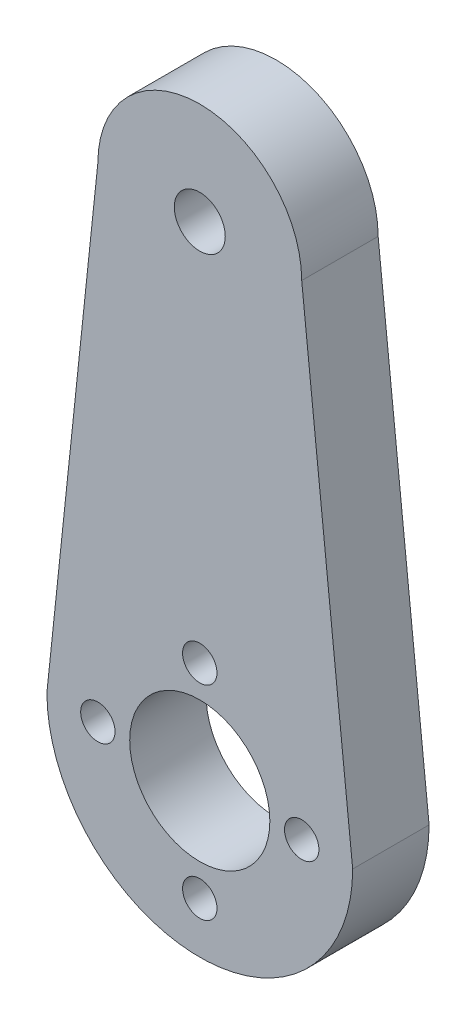
ISO-10303-21;
HEADER;
FILE_DESCRIPTION(('STEP AP214'),'2;1');
FILE_NAME('part.step','',(''),(''),'','','');
FILE_SCHEMA(('AUTOMOTIVE_DESIGN { 1 0 10303 214 1 1 1 1 }'));
ENDSEC;
DATA;
#1=APPLICATION_CONTEXT('core data for automotive mechanical design processes');
#2=APPLICATION_PROTOCOL_DEFINITION('international standard','automotive_design',2000,#1);
#3=PRODUCT_CONTEXT('',#1,'mechanical');
#4=PRODUCT('Part','Part','',(#3));
#5=PRODUCT_RELATED_PRODUCT_CATEGORY('part','',(#4));
#6=PRODUCT_DEFINITION_FORMATION('','',#4);
#7=PRODUCT_DEFINITION_CONTEXT('part definition',#1,'design');
#8=PRODUCT_DEFINITION('design','',#6,#7);
#9=PRODUCT_DEFINITION_SHAPE('','',#8);
#10=(LENGTH_UNIT() NAMED_UNIT(*) SI_UNIT(.MILLI.,.METRE.));
#11=(NAMED_UNIT(*) PLANE_ANGLE_UNIT() SI_UNIT($,.RADIAN.));
#12=(NAMED_UNIT(*) SI_UNIT($,.STERADIAN.) SOLID_ANGLE_UNIT());
#13=UNCERTAINTY_MEASURE_WITH_UNIT(LENGTH_MEASURE(1.E-05),#10,'distance_accuracy_value','');
#14=(GEOMETRIC_REPRESENTATION_CONTEXT(3) GLOBAL_UNCERTAINTY_ASSIGNED_CONTEXT((#13)) GLOBAL_UNIT_ASSIGNED_CONTEXT((#10,
#11,#12)) REPRESENTATION_CONTEXT('',''));
#15=CARTESIAN_POINT('',(0.,0.,0.));
#16=DIRECTION('',(0.,0.,1.));
#17=DIRECTION('',(1.,0.,0.));
#18=AXIS2_PLACEMENT_3D('',#15,#16,#17);
#19=CARTESIAN_POINT('',(0.,0.,6.));
#20=DIRECTION('',(0.,0.,-1.));
#21=DIRECTION('',(-1.,0.,0.));
#22=AXIS2_PLACEMENT_3D('',#19,#20,#21);
#23=CYLINDRICAL_SURFACE('',#22,12.);
#24=CARTESIAN_POINT('',(0.,0.,0.));
#25=DIRECTION('',(0.,0.,1.));
#26=DIRECTION('',(-1.,0.,0.));
#27=AXIS2_PLACEMENT_3D('',#24,#25,#26);
#28=CIRCLE('',#27,12.);
#29=CARTESIAN_POINT('',(-12.,0.,0.));
#30=VERTEX_POINT('',#29);
#31=CARTESIAN_POINT('',(12.,0.,0.));
#32=VERTEX_POINT('',#31);
#33=EDGE_CURVE('E95',#30,#32,#28,.T.);
#34=ORIENTED_EDGE('',*,*,#33,.T.);
#35=DIRECTION('',(0.,0.,-1.));
#36=VECTOR('',#35,1.);
#37=CARTESIAN_POINT('',(12.,0.,6.));
#38=LINE('',#37,#36);
#39=CARTESIAN_POINT('',(12.,0.,6.));
#40=VERTEX_POINT('',#39);
#41=EDGE_CURVE('E11',#40,#32,#38,.T.);
#42=ORIENTED_EDGE('',*,*,#41,.F.);
#43=CARTESIAN_POINT('',(0.,0.,6.));
#44=DIRECTION('',(0.,0.,1.));
#45=DIRECTION('',(-1.,0.,0.));
#46=AXIS2_PLACEMENT_3D('',#43,#44,#45);
#47=CIRCLE('',#46,12.);
#48=CARTESIAN_POINT('',(-12.,0.,6.));
#49=VERTEX_POINT('',#48);
#50=EDGE_CURVE('E83',#49,#40,#47,.T.);
#51=ORIENTED_EDGE('',*,*,#50,.F.);
#52=DIRECTION('',(0.,0.,-1.));
#53=VECTOR('',#52,1.);
#54=CARTESIAN_POINT('',(-12.,0.,6.));
#55=LINE('',#54,#53);
#56=EDGE_CURVE('E91',#49,#30,#55,.T.);
#57=ORIENTED_EDGE('',*,*,#56,.T.);
#58=EDGE_LOOP('',(#34,#42,#51,#57));
#59=FACE_BOUND('',#58,.T.);
#60=ADVANCED_FACE('F32',(#59),#23,.T.);
#61=CARTESIAN_POINT('',(12.,0.,6.));
#62=DIRECTION('',(-0.994505452921406,-0.104684784518043,0.));
#63=DIRECTION('',(0.104684784518043,-0.994505452921406,0.));
#64=AXIS2_PLACEMENT_3D('',#61,#62,#63);
#65=PLANE('',#64);
#66=DIRECTION('',(-0.104684784518043,0.994505452921406,0.));
#67=VECTOR('',#66,1.);
#68=CARTESIAN_POINT('',(12.,0.,0.));
#69=LINE('',#68,#67);
#70=CARTESIAN_POINT('',(8.,38.,0.));
#71=VERTEX_POINT('',#70);
#72=EDGE_CURVE('E87',#32,#71,#69,.T.);
#73=ORIENTED_EDGE('',*,*,#72,.T.);
#74=DIRECTION('',(0.,0.,-1.));
#75=VECTOR('',#74,1.);
#76=CARTESIAN_POINT('',(8.,38.,6.));
#77=LINE('',#76,#75);
#78=CARTESIAN_POINT('',(8.,38.,6.));
#79=VERTEX_POINT('',#78);
#80=EDGE_CURVE('E40',#79,#71,#77,.T.);
#81=ORIENTED_EDGE('',*,*,#80,.F.);
#82=DIRECTION('',(-0.104684784518043,0.994505452921406,0.));
#83=VECTOR('',#82,1.);
#84=CARTESIAN_POINT('',(12.,0.,6.));
#85=LINE('',#84,#83);
#86=EDGE_CURVE('E78',#40,#79,#85,.T.);
#87=ORIENTED_EDGE('',*,*,#86,.F.);
#88=ORIENTED_EDGE('',*,*,#41,.T.);
#89=EDGE_LOOP('',(#73,#81,#87,#88));
#90=FACE_BOUND('',#89,.T.);
#91=ADVANCED_FACE('F86',(#90),#65,.F.);
#92=CARTESIAN_POINT('',(0.,38.,6.));
#93=DIRECTION('',(0.,0.,-1.));
#94=DIRECTION('',(-1.,0.,0.));
#95=AXIS2_PLACEMENT_3D('',#92,#93,#94);
#96=CYLINDRICAL_SURFACE('',#95,8.);
#97=CARTESIAN_POINT('',(0.,38.,0.));
#98=DIRECTION('',(0.,0.,1.));
#99=DIRECTION('',(1.,0.,0.));
#100=AXIS2_PLACEMENT_3D('',#97,#98,#99);
#101=CIRCLE('',#100,8.);
#102=CARTESIAN_POINT('',(-8.,38.,0.));
#103=VERTEX_POINT('',#102);
#104=EDGE_CURVE('E65',#71,#103,#101,.T.);
#105=ORIENTED_EDGE('',*,*,#104,.T.);
#106=DIRECTION('',(0.,0.,-1.));
#107=VECTOR('',#106,1.);
#108=CARTESIAN_POINT('',(-8.,38.,6.));
#109=LINE('',#108,#107);
#110=CARTESIAN_POINT('',(-8.,38.,6.));
#111=VERTEX_POINT('',#110);
#112=EDGE_CURVE('E88',#111,#103,#109,.T.);
#113=ORIENTED_EDGE('',*,*,#112,.F.);
#114=CARTESIAN_POINT('',(0.,38.,6.));
#115=DIRECTION('',(0.,0.,1.));
#116=DIRECTION('',(1.,0.,0.));
#117=AXIS2_PLACEMENT_3D('',#114,#115,#116);
#118=CIRCLE('',#117,8.);
#119=EDGE_CURVE('E81',#79,#111,#118,.T.);
#120=ORIENTED_EDGE('',*,*,#119,.F.);
#121=ORIENTED_EDGE('',*,*,#80,.T.);
#122=EDGE_LOOP('',(#105,#113,#120,#121));
#123=FACE_BOUND('',#122,.T.);
#124=ADVANCED_FACE('F89',(#123),#96,.T.);
#125=CARTESIAN_POINT('',(-12.,0.,6.));
#126=DIRECTION('',(0.994505452921406,-0.104684784518043,0.));
#127=DIRECTION('',(0.104684784518043,0.994505452921406,0.));
#128=AXIS2_PLACEMENT_3D('',#125,#126,#127);
#129=PLANE('',#128);
#130=DIRECTION('',(-0.104684784518043,-0.994505452921406,0.));
#131=VECTOR('',#130,1.);
#132=CARTESIAN_POINT('',(-12.,0.,0.));
#133=LINE('',#132,#131);
#134=EDGE_CURVE('E71',#103,#30,#133,.T.);
#135=ORIENTED_EDGE('',*,*,#134,.T.);
#136=ORIENTED_EDGE('',*,*,#56,.F.);
#137=DIRECTION('',(-0.104684784518043,-0.994505452921406,0.));
#138=VECTOR('',#137,1.);
#139=CARTESIAN_POINT('',(-12.,0.,6.));
#140=LINE('',#139,#138);
#141=EDGE_CURVE('E48',#111,#49,#140,.T.);
#142=ORIENTED_EDGE('',*,*,#141,.F.);
#143=ORIENTED_EDGE('',*,*,#112,.T.);
#144=EDGE_LOOP('',(#135,#136,#142,#143));
#145=FACE_BOUND('',#144,.T.);
#146=ADVANCED_FACE('F103',(#145),#129,.F.);
#147=CARTESIAN_POINT('',(0.,0.,6.));
#148=DIRECTION('',(0.,0.,-1.));
#149=DIRECTION('',(-1.,0.,0.));
#150=AXIS2_PLACEMENT_3D('',#147,#148,#149);
#151=PLANE('',#150);
#152=CARTESIAN_POINT('',(0.,8.,6.));
#153=DIRECTION('',(0.,0.,-1.));
#154=DIRECTION('',(-1.,0.,0.));
#155=AXIS2_PLACEMENT_3D('',#152,#153,#154);
#156=CIRCLE('',#155,1.35);
#157=CARTESIAN_POINT('',(-1.35,8.,6.));
#158=VERTEX_POINT('',#157);
#159=EDGE_CURVE('E114',#158,#158,#156,.T.);
#160=ORIENTED_EDGE('',*,*,#159,.T.);
#161=EDGE_LOOP('',(#160));
#162=FACE_BOUND('',#161,.T.);
#163=CARTESIAN_POINT('',(-8.,0.,6.));
#164=DIRECTION('',(0.,0.,-1.));
#165=DIRECTION('',(-1.,0.,0.));
#166=AXIS2_PLACEMENT_3D('',#163,#164,#165);
#167=CIRCLE('',#166,1.35);
#168=CARTESIAN_POINT('',(-9.35,0.,6.));
#169=VERTEX_POINT('',#168);
#170=EDGE_CURVE('E117',#169,#169,#167,.T.);
#171=ORIENTED_EDGE('',*,*,#170,.T.);
#172=EDGE_LOOP('',(#171));
#173=FACE_BOUND('',#172,.T.);
#174=CARTESIAN_POINT('',(0.,-8.,6.));
#175=DIRECTION('',(0.,0.,-1.));
#176=DIRECTION('',(-1.,0.,0.));
#177=AXIS2_PLACEMENT_3D('',#174,#175,#176);
#178=CIRCLE('',#177,1.35);
#179=CARTESIAN_POINT('',(-1.35,-8.,6.));
#180=VERTEX_POINT('',#179);
#181=EDGE_CURVE('E120',#180,#180,#178,.T.);
#182=ORIENTED_EDGE('',*,*,#181,.T.);
#183=EDGE_LOOP('',(#182));
#184=FACE_BOUND('',#183,.T.);
#185=CARTESIAN_POINT('',(0.,38.,6.));
#186=DIRECTION('',(0.,0.,-1.));
#187=DIRECTION('',(-1.,0.,0.));
#188=AXIS2_PLACEMENT_3D('',#185,#186,#187);
#189=CIRCLE('',#188,2.);
#190=CARTESIAN_POINT('',(-2.,38.,6.));
#191=VERTEX_POINT('',#190);
#192=EDGE_CURVE('E123',#191,#191,#189,.T.);
#193=ORIENTED_EDGE('',*,*,#192,.T.);
#194=EDGE_LOOP('',(#193));
#195=FACE_BOUND('',#194,.T.);
#196=CARTESIAN_POINT('',(8.,0.,6.));
#197=DIRECTION('',(0.,0.,-1.));
#198=DIRECTION('',(-1.,0.,0.));
#199=AXIS2_PLACEMENT_3D('',#196,#197,#198);
#200=CIRCLE('',#199,1.35);
#201=CARTESIAN_POINT('',(6.65,0.,6.));
#202=VERTEX_POINT('',#201);
#203=EDGE_CURVE('E126',#202,#202,#200,.T.);
#204=ORIENTED_EDGE('',*,*,#203,.T.);
#205=EDGE_LOOP('',(#204));
#206=FACE_BOUND('',#205,.T.);
#207=CARTESIAN_POINT('',(0.,0.,6.));
#208=DIRECTION('',(0.,0.,-1.));
#209=DIRECTION('',(-1.,0.,0.));
#210=AXIS2_PLACEMENT_3D('',#207,#208,#209);
#211=CIRCLE('',#210,5.5);
#212=CARTESIAN_POINT('',(-5.5,0.,6.));
#213=VERTEX_POINT('',#212);
#214=EDGE_CURVE('E98',#213,#213,#211,.T.);
#215=ORIENTED_EDGE('',*,*,#214,.T.);
#216=EDGE_LOOP('',(#215));
#217=FACE_BOUND('',#216,.T.);
#218=ORIENTED_EDGE('',*,*,#50,.T.);
#219=ORIENTED_EDGE('',*,*,#86,.T.);
#220=ORIENTED_EDGE('',*,*,#119,.T.);
#221=ORIENTED_EDGE('',*,*,#141,.T.);
#222=EDGE_LOOP('',(#218,#219,#220,#221));
#223=FACE_BOUND('',#222,.T.);
#224=ADVANCED_FACE('F79',(#162,#173,#184,#195,#206,#217,#223),#151,.F.);
#225=CARTESIAN_POINT('',(0.,0.,0.));
#226=DIRECTION('',(0.,0.,-1.));
#227=DIRECTION('',(-1.,0.,0.));
#228=AXIS2_PLACEMENT_3D('',#225,#226,#227);
#229=PLANE('',#228);
#230=CARTESIAN_POINT('',(0.,8.,0.));
#231=DIRECTION('',(0.,0.,1.));
#232=DIRECTION('',(1.,0.,0.));
#233=AXIS2_PLACEMENT_3D('',#230,#231,#232);
#234=CIRCLE('',#233,1.35);
#235=CARTESIAN_POINT('',(1.35,8.,0.));
#236=VERTEX_POINT('',#235);
#237=EDGE_CURVE('E136',#236,#236,#234,.T.);
#238=ORIENTED_EDGE('',*,*,#237,.T.);
#239=EDGE_LOOP('',(#238));
#240=FACE_BOUND('',#239,.T.);
#241=CARTESIAN_POINT('',(-8.,0.,0.));
#242=DIRECTION('',(0.,0.,1.));
#243=DIRECTION('',(1.,0.,0.));
#244=AXIS2_PLACEMENT_3D('',#241,#242,#243);
#245=CIRCLE('',#244,1.35);
#246=CARTESIAN_POINT('',(-6.65,0.,0.));
#247=VERTEX_POINT('',#246);
#248=EDGE_CURVE('E139',#247,#247,#245,.T.);
#249=ORIENTED_EDGE('',*,*,#248,.T.);
#250=EDGE_LOOP('',(#249));
#251=FACE_BOUND('',#250,.T.);
#252=CARTESIAN_POINT('',(0.,-8.,0.));
#253=DIRECTION('',(0.,0.,1.));
#254=DIRECTION('',(1.,0.,0.));
#255=AXIS2_PLACEMENT_3D('',#252,#253,#254);
#256=CIRCLE('',#255,1.35);
#257=CARTESIAN_POINT('',(1.35,-8.,0.));
#258=VERTEX_POINT('',#257);
#259=EDGE_CURVE('E133',#258,#258,#256,.T.);
#260=ORIENTED_EDGE('',*,*,#259,.T.);
#261=EDGE_LOOP('',(#260));
#262=FACE_BOUND('',#261,.T.);
#263=CARTESIAN_POINT('',(0.,38.,0.));
#264=DIRECTION('',(0.,0.,1.));
#265=DIRECTION('',(1.,0.,0.));
#266=AXIS2_PLACEMENT_3D('',#263,#264,#265);
#267=CIRCLE('',#266,2.);
#268=CARTESIAN_POINT('',(2.,38.,0.));
#269=VERTEX_POINT('',#268);
#270=EDGE_CURVE('E130',#269,#269,#267,.T.);
#271=ORIENTED_EDGE('',*,*,#270,.T.);
#272=EDGE_LOOP('',(#271));
#273=FACE_BOUND('',#272,.T.);
#274=CARTESIAN_POINT('',(8.,0.,0.));
#275=DIRECTION('',(0.,0.,1.));
#276=DIRECTION('',(1.,0.,0.));
#277=AXIS2_PLACEMENT_3D('',#274,#275,#276);
#278=CIRCLE('',#277,1.35);
#279=CARTESIAN_POINT('',(9.35,0.,0.));
#280=VERTEX_POINT('',#279);
#281=EDGE_CURVE('E129',#280,#280,#278,.T.);
#282=ORIENTED_EDGE('',*,*,#281,.T.);
#283=EDGE_LOOP('',(#282));
#284=FACE_BOUND('',#283,.T.);
#285=CARTESIAN_POINT('',(0.,0.,0.));
#286=DIRECTION('',(0.,0.,1.));
#287=DIRECTION('',(1.,0.,0.));
#288=AXIS2_PLACEMENT_3D('',#285,#286,#287);
#289=CIRCLE('',#288,5.5);
#290=CARTESIAN_POINT('',(5.5,0.,0.));
#291=VERTEX_POINT('',#290);
#292=EDGE_CURVE('E111',#291,#291,#289,.T.);
#293=ORIENTED_EDGE('',*,*,#292,.T.);
#294=EDGE_LOOP('',(#293));
#295=FACE_BOUND('',#294,.T.);
#296=ORIENTED_EDGE('',*,*,#33,.F.);
#297=ORIENTED_EDGE('',*,*,#134,.F.);
#298=ORIENTED_EDGE('',*,*,#104,.F.);
#299=ORIENTED_EDGE('',*,*,#72,.F.);
#300=EDGE_LOOP('',(#296,#297,#298,#299));
#301=FACE_BOUND('',#300,.T.);
#302=ADVANCED_FACE('F106',(#240,#251,#262,#273,#284,#295,#301),#229,.T.);
#303=CARTESIAN_POINT('',(0.,0.,0.));
#304=DIRECTION('',(0.,0.,1.));
#305=DIRECTION('',(1.,0.,0.));
#306=AXIS2_PLACEMENT_3D('',#303,#304,#305);
#307=CYLINDRICAL_SURFACE('',#306,5.5);
#308=ORIENTED_EDGE('',*,*,#292,.F.);
#309=EDGE_LOOP('',(#308));
#310=FACE_BOUND('',#309,.T.);
#311=ORIENTED_EDGE('',*,*,#214,.F.);
#312=EDGE_LOOP('',(#311));
#313=FACE_BOUND('',#312,.T.);
#314=ADVANCED_FACE('F165',(#310,#313),#307,.F.);
#315=CARTESIAN_POINT('',(8.,0.,0.));
#316=DIRECTION('',(0.,0.,1.));
#317=DIRECTION('',(1.,0.,0.));
#318=AXIS2_PLACEMENT_3D('',#315,#316,#317);
#319=CYLINDRICAL_SURFACE('',#318,1.35);
#320=ORIENTED_EDGE('',*,*,#281,.F.);
#321=EDGE_LOOP('',(#320));
#322=FACE_BOUND('',#321,.T.);
#323=ORIENTED_EDGE('',*,*,#203,.F.);
#324=EDGE_LOOP('',(#323));
#325=FACE_BOUND('',#324,.T.);
#326=ADVANCED_FACE('F167',(#322,#325),#319,.F.);
#327=CARTESIAN_POINT('',(0.,38.,0.));
#328=DIRECTION('',(0.,0.,1.));
#329=DIRECTION('',(1.,0.,0.));
#330=AXIS2_PLACEMENT_3D('',#327,#328,#329);
#331=CYLINDRICAL_SURFACE('',#330,2.);
#332=ORIENTED_EDGE('',*,*,#270,.F.);
#333=EDGE_LOOP('',(#332));
#334=FACE_BOUND('',#333,.T.);
#335=ORIENTED_EDGE('',*,*,#192,.F.);
#336=EDGE_LOOP('',(#335));
#337=FACE_BOUND('',#336,.T.);
#338=ADVANCED_FACE('F151',(#334,#337),#331,.F.);
#339=CARTESIAN_POINT('',(0.,-8.,0.));
#340=DIRECTION('',(0.,0.,1.));
#341=DIRECTION('',(1.,0.,0.));
#342=AXIS2_PLACEMENT_3D('',#339,#340,#341);
#343=CYLINDRICAL_SURFACE('',#342,1.35);
#344=ORIENTED_EDGE('',*,*,#259,.F.);
#345=EDGE_LOOP('',(#344));
#346=FACE_BOUND('',#345,.T.);
#347=ORIENTED_EDGE('',*,*,#181,.F.);
#348=EDGE_LOOP('',(#347));
#349=FACE_BOUND('',#348,.T.);
#350=ADVANCED_FACE('F147',(#346,#349),#343,.F.);
#351=CARTESIAN_POINT('',(-8.,0.,0.));
#352=DIRECTION('',(0.,0.,1.));
#353=DIRECTION('',(1.,0.,0.));
#354=AXIS2_PLACEMENT_3D('',#351,#352,#353);
#355=CYLINDRICAL_SURFACE('',#354,1.35);
#356=ORIENTED_EDGE('',*,*,#248,.F.);
#357=EDGE_LOOP('',(#356));
#358=FACE_BOUND('',#357,.T.);
#359=ORIENTED_EDGE('',*,*,#170,.F.);
#360=EDGE_LOOP('',(#359));
#361=FACE_BOUND('',#360,.T.);
#362=ADVANCED_FACE('F150',(#358,#361),#355,.F.);
#363=CARTESIAN_POINT('',(0.,8.,0.));
#364=DIRECTION('',(0.,0.,1.));
#365=DIRECTION('',(1.,0.,0.));
#366=AXIS2_PLACEMENT_3D('',#363,#364,#365);
#367=CYLINDRICAL_SURFACE('',#366,1.35);
#368=ORIENTED_EDGE('',*,*,#237,.F.);
#369=EDGE_LOOP('',(#368));
#370=FACE_BOUND('',#369,.T.);
#371=ORIENTED_EDGE('',*,*,#159,.F.);
#372=EDGE_LOOP('',(#371));
#373=FACE_BOUND('',#372,.T.);
#374=ADVANCED_FACE('F235',(#370,#373),#367,.F.);
#375=CLOSED_SHELL('',(#60,#91,#124,#146,#224,#302,#314,#326,#338,#350,#362,#374));
#376=MANIFOLD_SOLID_BREP('B2',#375);
#377=ADVANCED_BREP_SHAPE_REPRESENTATION('',(#18,#376),#14);
#378=SHAPE_DEFINITION_REPRESENTATION(#9,#377);
ENDSEC;
END-ISO-10303-21;
